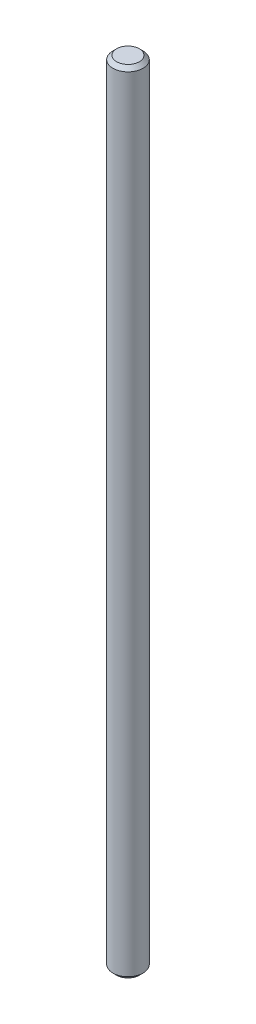
ISO-10303-21;
HEADER;
FILE_DESCRIPTION(('STEP AP214'),'2;1');
FILE_NAME('part.step','',(''),(''),'','','');
FILE_SCHEMA(('AUTOMOTIVE_DESIGN { 1 0 10303 214 1 1 1 1 }'));
ENDSEC;
DATA;
#1=APPLICATION_CONTEXT('core data for automotive mechanical design processes');
#2=APPLICATION_PROTOCOL_DEFINITION('international standard','automotive_design',2000,#1);
#3=PRODUCT_CONTEXT('',#1,'mechanical');
#4=PRODUCT('Part','Part','',(#3));
#5=PRODUCT_RELATED_PRODUCT_CATEGORY('part','',(#4));
#6=PRODUCT_DEFINITION_FORMATION('','',#4);
#7=PRODUCT_DEFINITION_CONTEXT('part definition',#1,'design');
#8=PRODUCT_DEFINITION('design','',#6,#7);
#9=PRODUCT_DEFINITION_SHAPE('','',#8);
#10=(LENGTH_UNIT() NAMED_UNIT(*) SI_UNIT(.MILLI.,.METRE.));
#11=(NAMED_UNIT(*) PLANE_ANGLE_UNIT() SI_UNIT($,.RADIAN.));
#12=(NAMED_UNIT(*) SI_UNIT($,.STERADIAN.) SOLID_ANGLE_UNIT());
#13=UNCERTAINTY_MEASURE_WITH_UNIT(LENGTH_MEASURE(1.E-05),#10,'distance_accuracy_value','');
#14=(GEOMETRIC_REPRESENTATION_CONTEXT(3) GLOBAL_UNCERTAINTY_ASSIGNED_CONTEXT((#13)) GLOBAL_UNIT_ASSIGNED_CONTEXT((#10,
#11,#12)) REPRESENTATION_CONTEXT('',''));
#15=CARTESIAN_POINT('',(0.,0.,0.));
#16=DIRECTION('',(0.,0.,1.));
#17=DIRECTION('',(1.,0.,0.));
#18=AXIS2_PLACEMENT_3D('',#15,#16,#17);
#19=CARTESIAN_POINT('',(0.,105.,0.));
#20=DIRECTION('',(0.,-1.,0.));
#21=DIRECTION('',(0.,0.,-1.));
#22=AXIS2_PLACEMENT_3D('',#19,#20,#21);
#23=CYLINDRICAL_SURFACE('',#22,2.);
#24=CARTESIAN_POINT('',(0.,0.499999999999973,0.));
#25=DIRECTION('',(0.,1.,0.));
#26=DIRECTION('',(0.,0.,1.));
#27=AXIS2_PLACEMENT_3D('',#24,#25,#26);
#28=CIRCLE('',#27,2.);
#29=CARTESIAN_POINT('',(0.,0.499999999999973,2.));
#30=VERTEX_POINT('',#29);
#31=EDGE_CURVE('E45',#30,#30,#28,.T.);
#32=ORIENTED_EDGE('',*,*,#31,.T.);
#33=EDGE_LOOP('',(#32));
#34=FACE_BOUND('',#33,.T.);
#35=CARTESIAN_POINT('',(0.,104.5,0.));
#36=DIRECTION('',(0.,1.,0.));
#37=DIRECTION('',(0.,0.,1.));
#38=AXIS2_PLACEMENT_3D('',#35,#36,#37);
#39=CIRCLE('',#38,2.);
#40=CARTESIAN_POINT('',(0.,104.5,2.));
#41=VERTEX_POINT('',#40);
#42=EDGE_CURVE('E49',#41,#41,#39,.F.);
#43=ORIENTED_EDGE('',*,*,#42,.T.);
#44=EDGE_LOOP('',(#43));
#45=FACE_BOUND('',#44,.T.);
#46=ADVANCED_FACE('F33',(#34,#45),#23,.T.);
#47=CARTESIAN_POINT('',(0.,105.,0.));
#48=DIRECTION('',(0.,1.,0.));
#49=DIRECTION('',(0.,0.,1.));
#50=AXIS2_PLACEMENT_3D('',#47,#48,#49);
#51=PLANE('',#50);
#52=CARTESIAN_POINT('',(0.,105.,0.));
#53=DIRECTION('',(0.,1.,0.));
#54=DIRECTION('',(0.,0.,1.));
#55=AXIS2_PLACEMENT_3D('',#52,#53,#54);
#56=CIRCLE('',#55,1.5);
#57=CARTESIAN_POINT('',(0.,105.,1.5));
#58=VERTEX_POINT('',#57);
#59=EDGE_CURVE('E10',#58,#58,#56,.T.);
#60=ORIENTED_EDGE('',*,*,#59,.T.);
#61=EDGE_LOOP('',(#60));
#62=FACE_BOUND('',#61,.T.);
#63=ADVANCED_FACE('F65',(#62),#51,.T.);
#64=CARTESIAN_POINT('',(0.,0.,0.));
#65=DIRECTION('',(0.,1.,0.));
#66=DIRECTION('',(0.,0.,1.));
#67=AXIS2_PLACEMENT_3D('',#64,#65,#66);
#68=PLANE('',#67);
#69=CARTESIAN_POINT('',(0.,0.,0.));
#70=DIRECTION('',(0.,1.,0.));
#71=DIRECTION('',(0.,0.,1.));
#72=AXIS2_PLACEMENT_3D('',#69,#70,#71);
#73=CIRCLE('',#72,1.50000000000002);
#74=CARTESIAN_POINT('',(0.,0.,1.50000000000002));
#75=VERTEX_POINT('',#74);
#76=EDGE_CURVE('E41',#75,#75,#73,.F.);
#77=ORIENTED_EDGE('',*,*,#76,.T.);
#78=EDGE_LOOP('',(#77));
#79=FACE_BOUND('',#78,.T.);
#80=ADVANCED_FACE('F62',(#79),#68,.F.);
#81=CARTESIAN_POINT('',(0.,0.499999999999973,0.));
#82=DIRECTION('',(0.,1.,0.));
#83=DIRECTION('',(0.,0.,1.));
#84=AXIS2_PLACEMENT_3D('',#81,#82,#83);
#85=CONICAL_SURFACE('',#84,2.,0.78539816339746);
#86=ORIENTED_EDGE('',*,*,#76,.F.);
#87=EDGE_LOOP('',(#86));
#88=FACE_BOUND('',#87,.T.);
#89=ORIENTED_EDGE('',*,*,#31,.F.);
#90=EDGE_LOOP('',(#89));
#91=FACE_BOUND('',#90,.T.);
#92=ADVANCED_FACE('F58',(#88,#91),#85,.T.);
#93=CARTESIAN_POINT('',(0.,105.,0.));
#94=DIRECTION('',(0.,-1.,0.));
#95=DIRECTION('',(0.,0.,-1.));
#96=AXIS2_PLACEMENT_3D('',#93,#94,#95);
#97=CONICAL_SURFACE('',#96,1.5,0.78539816339746);
#98=ORIENTED_EDGE('',*,*,#42,.F.);
#99=EDGE_LOOP('',(#98));
#100=FACE_BOUND('',#99,.T.);
#101=ORIENTED_EDGE('',*,*,#59,.F.);
#102=EDGE_LOOP('',(#101));
#103=FACE_BOUND('',#102,.T.);
#104=ADVANCED_FACE('F36',(#100,#103),#97,.T.);
#105=CLOSED_SHELL('',(#46,#63,#80,#92,#104));
#106=MANIFOLD_SOLID_BREP('B2',#105);
#107=ADVANCED_BREP_SHAPE_REPRESENTATION('',(#18,#106),#14);
#108=SHAPE_DEFINITION_REPRESENTATION(#9,#107);
ENDSEC;
END-ISO-10303-21;
